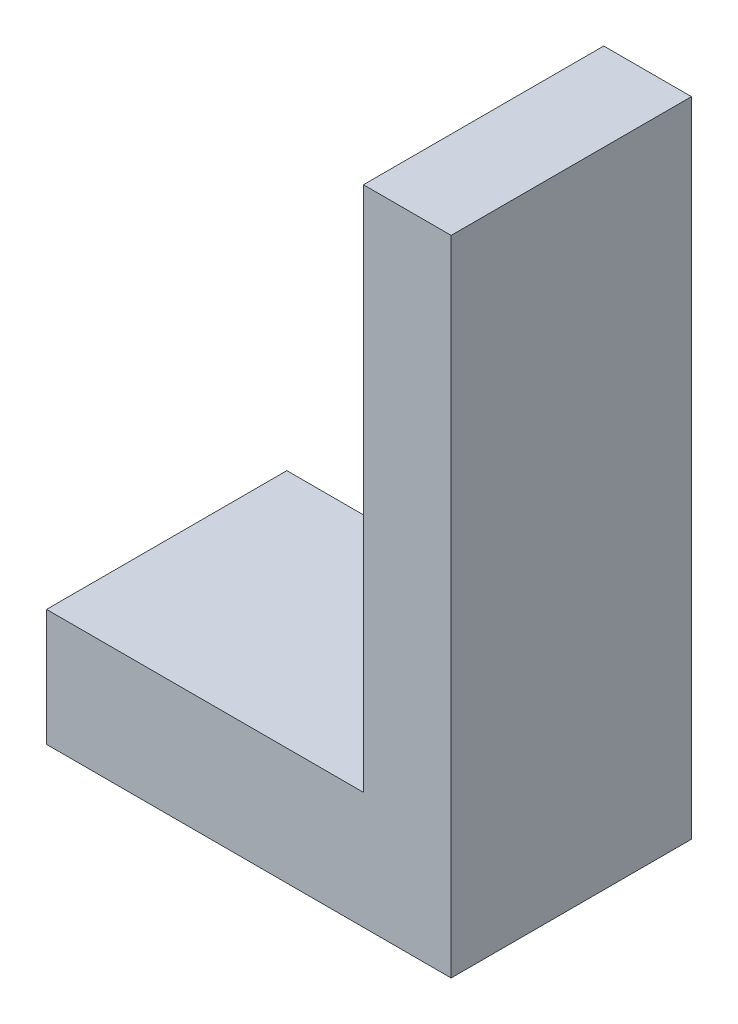
ISO-10303-21;
HEADER;
FILE_DESCRIPTION(('STEP AP214'),'2;1');
FILE_NAME('part.step','',(''),(''),'','','');
FILE_SCHEMA(('AUTOMOTIVE_DESIGN { 1 0 10303 214 1 1 1 1 }'));
ENDSEC;
DATA;
#1=APPLICATION_CONTEXT('core data for automotive mechanical design processes');
#2=APPLICATION_PROTOCOL_DEFINITION('international standard','automotive_design',2000,#1);
#3=PRODUCT_CONTEXT('',#1,'mechanical');
#4=PRODUCT('Part','Part','',(#3));
#5=PRODUCT_RELATED_PRODUCT_CATEGORY('part','',(#4));
#6=PRODUCT_DEFINITION_FORMATION('','',#4);
#7=PRODUCT_DEFINITION_CONTEXT('part definition',#1,'design');
#8=PRODUCT_DEFINITION('design','',#6,#7);
#9=PRODUCT_DEFINITION_SHAPE('','',#8);
#10=(LENGTH_UNIT() NAMED_UNIT(*) SI_UNIT(.MILLI.,.METRE.));
#11=(NAMED_UNIT(*) PLANE_ANGLE_UNIT() SI_UNIT($,.RADIAN.));
#12=(NAMED_UNIT(*) SI_UNIT($,.STERADIAN.) SOLID_ANGLE_UNIT());
#13=UNCERTAINTY_MEASURE_WITH_UNIT(LENGTH_MEASURE(1.E-05),#10,'distance_accuracy_value','');
#14=(GEOMETRIC_REPRESENTATION_CONTEXT(3) GLOBAL_UNCERTAINTY_ASSIGNED_CONTEXT((#13)) GLOBAL_UNIT_ASSIGNED_CONTEXT((#10,
#11,#12)) REPRESENTATION_CONTEXT('',''));
#15=CARTESIAN_POINT('',(0.,0.,0.));
#16=DIRECTION('',(0.,0.,1.));
#17=DIRECTION('',(1.,0.,0.));
#18=AXIS2_PLACEMENT_3D('',#15,#16,#17);
#19=CARTESIAN_POINT('',(0.,0.,0.));
#20=DIRECTION('',(0.,-1.,0.));
#21=DIRECTION('',(0.,0.,-1.));
#22=AXIS2_PLACEMENT_3D('',#19,#20,#21);
#23=PLANE('',#22);
#24=DIRECTION('',(0.,0.,1.));
#25=VECTOR('',#24,1.);
#26=CARTESIAN_POINT('',(7.51,0.,-5.15));
#27=LINE('',#26,#25);
#28=CARTESIAN_POINT('',(7.51,0.,-5.15));
#29=VERTEX_POINT('',#28);
#30=CARTESIAN_POINT('',(7.51,0.,19.85));
#31=VERTEX_POINT('',#30);
#32=EDGE_CURVE('E55',#29,#31,#27,.T.);
#33=ORIENTED_EDGE('',*,*,#32,.F.);
#34=DIRECTION('',(1.,0.,0.));
#35=VECTOR('',#34,1.);
#36=CARTESIAN_POINT('',(7.51,0.,-5.15));
#37=LINE('',#36,#35);
#38=CARTESIAN_POINT('',(-17.49,0.,-5.15));
#39=VERTEX_POINT('',#38);
#40=EDGE_CURVE('E312',#39,#29,#37,.T.);
#41=ORIENTED_EDGE('',*,*,#40,.F.);
#42=DIRECTION('',(0.,0.,-1.));
#43=VECTOR('',#42,1.);
#44=CARTESIAN_POINT('',(-17.49,0.,-5.15));
#45=LINE('',#44,#43);
#46=CARTESIAN_POINT('',(-17.49,0.,19.85));
#47=VERTEX_POINT('',#46);
#48=EDGE_CURVE('E317',#47,#39,#45,.T.);
#49=ORIENTED_EDGE('',*,*,#48,.F.);
#50=DIRECTION('',(-1.,0.,0.));
#51=VECTOR('',#50,1.);
#52=CARTESIAN_POINT('',(7.51,0.,19.85));
#53=LINE('',#52,#51);
#54=EDGE_CURVE('E324',#31,#47,#53,.T.);
#55=ORIENTED_EDGE('',*,*,#54,.F.);
#56=EDGE_LOOP('',(#33,#41,#49,#55));
#57=FACE_BOUND('',#56,.T.);
#58=DIRECTION('',(0.,0.,-1.));
#59=VECTOR('',#58,1.);
#60=CARTESIAN_POINT('',(34.6,0.,22.9));
#61=LINE('',#60,#59);
#62=CARTESIAN_POINT('',(34.6,0.,22.9));
#63=VERTEX_POINT('',#62);
#64=CARTESIAN_POINT('',(34.6,0.,-18.2));
#65=VERTEX_POINT('',#64);
#66=EDGE_CURVE('E116',#63,#65,#61,.T.);
#67=ORIENTED_EDGE('',*,*,#66,.F.);
#68=DIRECTION('',(1.,0.,0.));
#69=VECTOR('',#68,1.);
#70=CARTESIAN_POINT('',(-34.6,0.,22.9));
#71=LINE('',#70,#69);
#72=CARTESIAN_POINT('',(-34.6,0.,22.9));
#73=VERTEX_POINT('',#72);
#74=EDGE_CURVE('E139',#73,#63,#71,.T.);
#75=ORIENTED_EDGE('',*,*,#74,.F.);
#76=DIRECTION('',(0.,0.,1.));
#77=VECTOR('',#76,1.);
#78=CARTESIAN_POINT('',(-34.6,0.,22.9));
#79=LINE('',#78,#77);
#80=CARTESIAN_POINT('',(-34.6,0.,-18.2));
#81=VERTEX_POINT('',#80);
#82=EDGE_CURVE('E137',#81,#73,#79,.T.);
#83=ORIENTED_EDGE('',*,*,#82,.F.);
#84=DIRECTION('',(-1.,0.,0.));
#85=VECTOR('',#84,1.);
#86=CARTESIAN_POINT('',(0.,0.,-18.2));
#87=LINE('',#86,#85);
#88=EDGE_CURVE('E121',#65,#81,#87,.T.);
#89=ORIENTED_EDGE('',*,*,#88,.F.);
#90=EDGE_LOOP('',(#67,#75,#83,#89));
#91=FACE_BOUND('',#90,.T.);
#92=ADVANCED_FACE('F36',(#57,#91),#23,.T.);
#93=CARTESIAN_POINT('',(34.6,10.,22.9));
#94=DIRECTION('',(-1.,0.,0.));
#95=DIRECTION('',(0.,0.,1.));
#96=AXIS2_PLACEMENT_3D('',#93,#94,#95);
#97=PLANE('',#96);
#98=ORIENTED_EDGE('',*,*,#66,.T.);
#99=DIRECTION('',(0.,-1.,0.));
#100=VECTOR('',#99,1.);
#101=CARTESIAN_POINT('',(34.6,10.,-18.2));
#102=LINE('',#101,#100);
#103=CARTESIAN_POINT('',(34.6,110.,-18.2));
#104=VERTEX_POINT('',#103);
#105=EDGE_CURVE('E12',#104,#65,#102,.T.);
#106=ORIENTED_EDGE('',*,*,#105,.F.);
#107=DIRECTION('',(0.,0.,-1.));
#108=VECTOR('',#107,1.);
#109=CARTESIAN_POINT('',(34.6,110.,22.9));
#110=LINE('',#109,#108);
#111=CARTESIAN_POINT('',(34.6,110.,22.9));
#112=VERTEX_POINT('',#111);
#113=EDGE_CURVE('E146',#112,#104,#110,.T.);
#114=ORIENTED_EDGE('',*,*,#113,.F.);
#115=DIRECTION('',(0.,-1.,0.));
#116=VECTOR('',#115,1.);
#117=CARTESIAN_POINT('',(34.6,10.,22.9));
#118=LINE('',#117,#116);
#119=EDGE_CURVE('E141',#112,#63,#118,.T.);
#120=ORIENTED_EDGE('',*,*,#119,.T.);
#121=EDGE_LOOP('',(#98,#106,#114,#120));
#122=FACE_BOUND('',#121,.T.);
#123=ADVANCED_FACE('F161',(#122),#97,.F.);
#124=CARTESIAN_POINT('',(-34.6,10.,-18.2));
#125=DIRECTION('',(0.,0.,1.));
#126=DIRECTION('',(1.,0.,0.));
#127=AXIS2_PLACEMENT_3D('',#124,#125,#126);
#128=PLANE('',#127);
#129=ORIENTED_EDGE('',*,*,#88,.T.);
#130=DIRECTION('',(0.,-1.,0.));
#131=VECTOR('',#130,1.);
#132=CARTESIAN_POINT('',(-34.6,10.,-18.2));
#133=LINE('',#132,#131);
#134=CARTESIAN_POINT('',(-34.6,20.,-18.2));
#135=VERTEX_POINT('',#134);
#136=EDGE_CURVE('E46',#135,#81,#133,.T.);
#137=ORIENTED_EDGE('',*,*,#136,.F.);
#138=DIRECTION('',(-1.,0.,0.));
#139=VECTOR('',#138,1.);
#140=CARTESIAN_POINT('',(-34.6,20.,-18.2));
#141=LINE('',#140,#139);
#142=CARTESIAN_POINT('',(19.6,20.,-18.2));
#143=VERTEX_POINT('',#142);
#144=EDGE_CURVE('E108',#143,#135,#141,.T.);
#145=ORIENTED_EDGE('',*,*,#144,.F.);
#146=DIRECTION('',(0.,-1.,0.));
#147=VECTOR('',#146,1.);
#148=CARTESIAN_POINT('',(19.6,120.,-18.2));
#149=LINE('',#148,#147);
#150=CARTESIAN_POINT('',(19.6,110.,-18.2));
#151=VERTEX_POINT('',#150);
#152=EDGE_CURVE('E128',#151,#143,#149,.T.);
#153=ORIENTED_EDGE('',*,*,#152,.F.);
#154=DIRECTION('',(-1.,0.,0.));
#155=VECTOR('',#154,1.);
#156=CARTESIAN_POINT('',(-34.6,110.,-18.2));
#157=LINE('',#156,#155);
#158=EDGE_CURVE('E40',#104,#151,#157,.T.);
#159=ORIENTED_EDGE('',*,*,#158,.F.);
#160=ORIENTED_EDGE('',*,*,#105,.T.);
#161=EDGE_LOOP('',(#129,#137,#145,#153,#159,#160));
#162=FACE_BOUND('',#161,.T.);
#163=ADVANCED_FACE('F120',(#162),#128,.F.);
#164=CARTESIAN_POINT('',(-34.6,10.,22.9));
#165=DIRECTION('',(1.,0.,0.));
#166=DIRECTION('',(0.,0.,-1.));
#167=AXIS2_PLACEMENT_3D('',#164,#165,#166);
#168=PLANE('',#167);
#169=ORIENTED_EDGE('',*,*,#82,.T.);
#170=DIRECTION('',(0.,-1.,0.));
#171=VECTOR('',#170,1.);
#172=CARTESIAN_POINT('',(-34.6,10.,22.9));
#173=LINE('',#172,#171);
#174=CARTESIAN_POINT('',(-34.6,20.,22.9));
#175=VERTEX_POINT('',#174);
#176=EDGE_CURVE('E124',#175,#73,#173,.T.);
#177=ORIENTED_EDGE('',*,*,#176,.F.);
#178=DIRECTION('',(0.,0.,1.));
#179=VECTOR('',#178,1.);
#180=CARTESIAN_POINT('',(-34.6,20.,-22.9));
#181=LINE('',#180,#179);
#182=EDGE_CURVE('E112',#135,#175,#181,.T.);
#183=ORIENTED_EDGE('',*,*,#182,.F.);
#184=ORIENTED_EDGE('',*,*,#136,.T.);
#185=EDGE_LOOP('',(#169,#177,#183,#184));
#186=FACE_BOUND('',#185,.T.);
#187=ADVANCED_FACE('F126',(#186),#168,.F.);
#188=CARTESIAN_POINT('',(-34.6,10.,22.9));
#189=DIRECTION('',(0.,0.,-1.));
#190=DIRECTION('',(-1.,0.,0.));
#191=AXIS2_PLACEMENT_3D('',#188,#189,#190);
#192=PLANE('',#191);
#193=ORIENTED_EDGE('',*,*,#74,.T.);
#194=ORIENTED_EDGE('',*,*,#119,.F.);
#195=DIRECTION('',(1.,0.,0.));
#196=VECTOR('',#195,1.);
#197=CARTESIAN_POINT('',(-34.6,110.,22.9));
#198=LINE('',#197,#196);
#199=CARTESIAN_POINT('',(19.6,110.,22.9));
#200=VERTEX_POINT('',#199);
#201=EDGE_CURVE('E148',#200,#112,#198,.T.);
#202=ORIENTED_EDGE('',*,*,#201,.F.);
#203=DIRECTION('',(0.,-1.,0.));
#204=VECTOR('',#203,1.);
#205=CARTESIAN_POINT('',(19.6,120.,22.9));
#206=LINE('',#205,#204);
#207=CARTESIAN_POINT('',(19.6,20.,22.9));
#208=VERTEX_POINT('',#207);
#209=EDGE_CURVE('E131',#200,#208,#206,.T.);
#210=ORIENTED_EDGE('',*,*,#209,.T.);
#211=DIRECTION('',(1.,0.,0.));
#212=VECTOR('',#211,1.);
#213=CARTESIAN_POINT('',(-34.6,20.,22.9));
#214=LINE('',#213,#212);
#215=EDGE_CURVE('E87',#175,#208,#214,.T.);
#216=ORIENTED_EDGE('',*,*,#215,.F.);
#217=ORIENTED_EDGE('',*,*,#176,.T.);
#218=EDGE_LOOP('',(#193,#194,#202,#210,#216,#217));
#219=FACE_BOUND('',#218,.T.);
#220=ADVANCED_FACE('F158',(#219),#192,.F.);
#221=CARTESIAN_POINT('',(0.,20.,0.));
#222=DIRECTION('',(0.,1.,0.));
#223=DIRECTION('',(0.,0.,1.));
#224=AXIS2_PLACEMENT_3D('',#221,#222,#223);
#225=PLANE('',#224);
#226=DIRECTION('',(0.,0.,1.));
#227=VECTOR('',#226,1.);
#228=CARTESIAN_POINT('',(19.6,20.,22.9));
#229=LINE('',#228,#227);
#230=EDGE_CURVE('E113',#143,#208,#229,.T.);
#231=ORIENTED_EDGE('',*,*,#230,.F.);
#232=ORIENTED_EDGE('',*,*,#144,.T.);
#233=ORIENTED_EDGE('',*,*,#182,.T.);
#234=ORIENTED_EDGE('',*,*,#215,.T.);
#235=EDGE_LOOP('',(#231,#232,#233,#234));
#236=FACE_BOUND('',#235,.T.);
#237=ADVANCED_FACE('F110',(#236),#225,.T.);
#238=CARTESIAN_POINT('',(19.6,120.,22.9));
#239=DIRECTION('',(1.,0.,0.));
#240=DIRECTION('',(0.,0.,-1.));
#241=AXIS2_PLACEMENT_3D('',#238,#239,#240);
#242=PLANE('',#241);
#243=ORIENTED_EDGE('',*,*,#230,.T.);
#244=ORIENTED_EDGE('',*,*,#209,.F.);
#245=DIRECTION('',(0.,0.,1.));
#246=VECTOR('',#245,1.);
#247=CARTESIAN_POINT('',(19.6,110.,22.9));
#248=LINE('',#247,#246);
#249=EDGE_CURVE('E150',#151,#200,#248,.T.);
#250=ORIENTED_EDGE('',*,*,#249,.F.);
#251=ORIENTED_EDGE('',*,*,#152,.T.);
#252=EDGE_LOOP('',(#243,#244,#250,#251));
#253=FACE_BOUND('',#252,.T.);
#254=ADVANCED_FACE('F156',(#253),#242,.F.);
#255=CARTESIAN_POINT('',(0.,110.,0.));
#256=DIRECTION('',(0.,1.,0.));
#257=DIRECTION('',(0.,0.,1.));
#258=AXIS2_PLACEMENT_3D('',#255,#256,#257);
#259=PLANE('',#258);
#260=ORIENTED_EDGE('',*,*,#113,.T.);
#261=ORIENTED_EDGE('',*,*,#158,.T.);
#262=ORIENTED_EDGE('',*,*,#249,.T.);
#263=ORIENTED_EDGE('',*,*,#201,.T.);
#264=EDGE_LOOP('',(#260,#261,#262,#263));
#265=FACE_BOUND('',#264,.T.);
#266=ADVANCED_FACE('F38',(#265),#259,.T.);
#267=CARTESIAN_POINT('',(7.51,10.,-5.15));
#268=DIRECTION('',(1.,0.,0.));
#269=DIRECTION('',(0.,0.,-1.));
#270=AXIS2_PLACEMENT_3D('',#267,#268,#269);
#271=PLANE('',#270);
#272=ORIENTED_EDGE('',*,*,#32,.T.);
#273=DIRECTION('',(0.,-1.,0.));
#274=VECTOR('',#273,1.);
#275=CARTESIAN_POINT('',(7.51,10.,19.85));
#276=LINE('',#275,#274);
#277=CARTESIAN_POINT('',(7.51,10.,19.85));
#278=VERTEX_POINT('',#277);
#279=EDGE_CURVE('E322',#278,#31,#276,.T.);
#280=ORIENTED_EDGE('',*,*,#279,.F.);
#281=DIRECTION('',(0.,0.,1.));
#282=VECTOR('',#281,1.);
#283=CARTESIAN_POINT('',(7.51,10.,-5.15));
#284=LINE('',#283,#282);
#285=CARTESIAN_POINT('',(7.51,10.,-5.15));
#286=VERTEX_POINT('',#285);
#287=EDGE_CURVE('E304',#286,#278,#284,.T.);
#288=ORIENTED_EDGE('',*,*,#287,.F.);
#289=DIRECTION('',(0.,-1.,0.));
#290=VECTOR('',#289,1.);
#291=CARTESIAN_POINT('',(7.51,10.,-5.15));
#292=LINE('',#291,#290);
#293=EDGE_CURVE('E329',#286,#29,#292,.T.);
#294=ORIENTED_EDGE('',*,*,#293,.T.);
#295=EDGE_LOOP('',(#272,#280,#288,#294));
#296=FACE_BOUND('',#295,.T.);
#297=ADVANCED_FACE('F200',(#296),#271,.F.);
#298=CARTESIAN_POINT('',(7.51,10.,-5.15));
#299=DIRECTION('',(0.,0.,-1.));
#300=DIRECTION('',(-1.,0.,0.));
#301=AXIS2_PLACEMENT_3D('',#298,#299,#300);
#302=PLANE('',#301);
#303=ORIENTED_EDGE('',*,*,#40,.T.);
#304=ORIENTED_EDGE('',*,*,#293,.F.);
#305=DIRECTION('',(1.,0.,0.));
#306=VECTOR('',#305,1.);
#307=CARTESIAN_POINT('',(7.51,10.,-5.15));
#308=LINE('',#307,#306);
#309=CARTESIAN_POINT('',(-17.49,10.,-5.15));
#310=VERTEX_POINT('',#309);
#311=EDGE_CURVE('E310',#310,#286,#308,.T.);
#312=ORIENTED_EDGE('',*,*,#311,.F.);
#313=DIRECTION('',(0.,-1.,0.));
#314=VECTOR('',#313,1.);
#315=CARTESIAN_POINT('',(-17.49,10.,-5.15));
#316=LINE('',#315,#314);
#317=EDGE_CURVE('E331',#310,#39,#316,.T.);
#318=ORIENTED_EDGE('',*,*,#317,.T.);
#319=EDGE_LOOP('',(#303,#304,#312,#318));
#320=FACE_BOUND('',#319,.T.);
#321=ADVANCED_FACE('F208',(#320),#302,.F.);
#322=CARTESIAN_POINT('',(-17.49,10.,-5.15));
#323=DIRECTION('',(-1.,0.,0.));
#324=DIRECTION('',(0.,0.,1.));
#325=AXIS2_PLACEMENT_3D('',#322,#323,#324);
#326=PLANE('',#325);
#327=ORIENTED_EDGE('',*,*,#48,.T.);
#328=ORIENTED_EDGE('',*,*,#317,.F.);
#329=DIRECTION('',(0.,0.,-1.));
#330=VECTOR('',#329,1.);
#331=CARTESIAN_POINT('',(-17.49,10.,-5.15));
#332=LINE('',#331,#330);
#333=CARTESIAN_POINT('',(-17.49,10.,19.85));
#334=VERTEX_POINT('',#333);
#335=EDGE_CURVE('E314',#334,#310,#332,.T.);
#336=ORIENTED_EDGE('',*,*,#335,.F.);
#337=DIRECTION('',(0.,-1.,0.));
#338=VECTOR('',#337,1.);
#339=CARTESIAN_POINT('',(-17.49,10.,19.85));
#340=LINE('',#339,#338);
#341=EDGE_CURVE('E334',#334,#47,#340,.T.);
#342=ORIENTED_EDGE('',*,*,#341,.T.);
#343=EDGE_LOOP('',(#327,#328,#336,#342));
#344=FACE_BOUND('',#343,.T.);
#345=ADVANCED_FACE('F215',(#344),#326,.F.);
#346=CARTESIAN_POINT('',(7.51,10.,19.85));
#347=DIRECTION('',(0.,0.,1.));
#348=DIRECTION('',(1.,0.,0.));
#349=AXIS2_PLACEMENT_3D('',#346,#347,#348);
#350=PLANE('',#349);
#351=ORIENTED_EDGE('',*,*,#54,.T.);
#352=ORIENTED_EDGE('',*,*,#341,.F.);
#353=DIRECTION('',(-1.,0.,0.));
#354=VECTOR('',#353,1.);
#355=CARTESIAN_POINT('',(7.51,10.,19.85));
#356=LINE('',#355,#354);
#357=EDGE_CURVE('E308',#278,#334,#356,.T.);
#358=ORIENTED_EDGE('',*,*,#357,.F.);
#359=ORIENTED_EDGE('',*,*,#279,.T.);
#360=EDGE_LOOP('',(#351,#352,#358,#359));
#361=FACE_BOUND('',#360,.T.);
#362=ADVANCED_FACE('F223',(#361),#350,.F.);
#363=CARTESIAN_POINT('',(0.,10.,0.));
#364=DIRECTION('',(0.,-1.,0.));
#365=DIRECTION('',(0.,0.,-1.));
#366=AXIS2_PLACEMENT_3D('',#363,#364,#365);
#367=PLANE('',#366);
#368=ORIENTED_EDGE('',*,*,#287,.T.);
#369=ORIENTED_EDGE('',*,*,#357,.T.);
#370=ORIENTED_EDGE('',*,*,#335,.T.);
#371=ORIENTED_EDGE('',*,*,#311,.T.);
#372=EDGE_LOOP('',(#368,#369,#370,#371));
#373=FACE_BOUND('',#372,.T.);
#374=ADVANCED_FACE('F231',(#373),#367,.T.);
#375=CLOSED_SHELL('',(#92,#123,#163,#187,#220,#237,#254,#266,#297,#321,#345,#362,#374));
#376=MANIFOLD_SOLID_BREP('B2',#375);
#377=ADVANCED_BREP_SHAPE_REPRESENTATION('',(#18,#376),#14);
#378=SHAPE_DEFINITION_REPRESENTATION(#9,#377);
ENDSEC;
END-ISO-10303-21;
